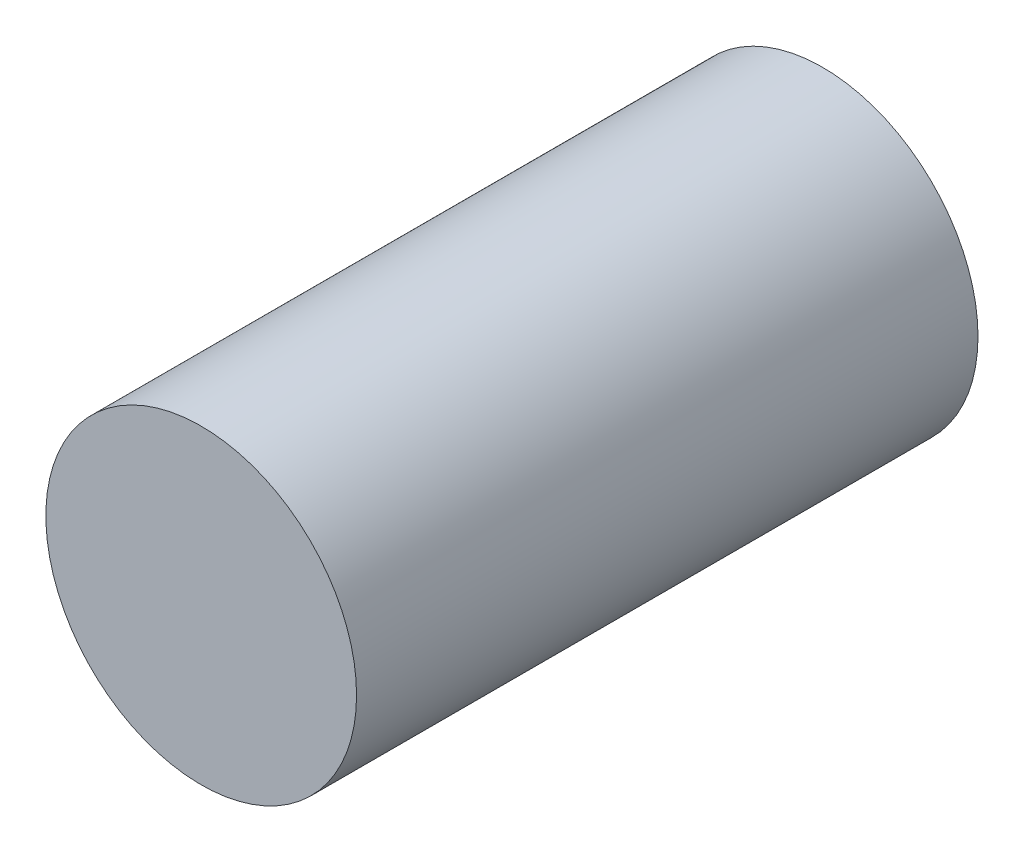
ISO-10303-21;
HEADER;
FILE_DESCRIPTION(('STEP AP214'),'2;1');
FILE_NAME('part.step','',(''),(''),'','','');
FILE_SCHEMA(('AUTOMOTIVE_DESIGN { 1 0 10303 214 1 1 1 1 }'));
ENDSEC;
DATA;
#1=APPLICATION_CONTEXT('core data for automotive mechanical design processes');
#2=APPLICATION_PROTOCOL_DEFINITION('international standard','automotive_design',2000,#1);
#3=PRODUCT_CONTEXT('',#1,'mechanical');
#4=PRODUCT('Part','Part','',(#3));
#5=PRODUCT_RELATED_PRODUCT_CATEGORY('part','',(#4));
#6=PRODUCT_DEFINITION_FORMATION('','',#4);
#7=PRODUCT_DEFINITION_CONTEXT('part definition',#1,'design');
#8=PRODUCT_DEFINITION('design','',#6,#7);
#9=PRODUCT_DEFINITION_SHAPE('','',#8);
#10=(LENGTH_UNIT() NAMED_UNIT(*) SI_UNIT(.MILLI.,.METRE.));
#11=(NAMED_UNIT(*) PLANE_ANGLE_UNIT() SI_UNIT($,.RADIAN.));
#12=(NAMED_UNIT(*) SI_UNIT($,.STERADIAN.) SOLID_ANGLE_UNIT());
#13=UNCERTAINTY_MEASURE_WITH_UNIT(LENGTH_MEASURE(1.E-05),#10,'distance_accuracy_value','');
#14=(GEOMETRIC_REPRESENTATION_CONTEXT(3) GLOBAL_UNCERTAINTY_ASSIGNED_CONTEXT((#13)) GLOBAL_UNIT_ASSIGNED_CONTEXT((#10,
#11,#12)) REPRESENTATION_CONTEXT('',''));
#15=CARTESIAN_POINT('',(0.,0.,0.));
#16=DIRECTION('',(0.,0.,1.));
#17=DIRECTION('',(1.,0.,0.));
#18=AXIS2_PLACEMENT_3D('',#15,#16,#17);
#19=CARTESIAN_POINT('',(0.,0.,2.00000108));
#20=DIRECTION('',(0.,0.,1.));
#21=DIRECTION('',(1.,0.,0.));
#22=AXIS2_PLACEMENT_3D('',#19,#20,#21);
#23=PLANE('',#22);
#24=CARTESIAN_POINT('',(0.,0.,2.00000108));
#25=DIRECTION('',(0.,0.,1.));
#26=DIRECTION('',(1.,0.,0.));
#27=AXIS2_PLACEMENT_3D('',#24,#25,#26);
#28=CIRCLE('',#27,0.499999);
#29=CARTESIAN_POINT('',(0.499999,0.,2.00000108));
#30=VERTEX_POINT('',#29);
#31=EDGE_CURVE('E10',#30,#30,#28,.T.);
#32=ORIENTED_EDGE('',*,*,#31,.T.);
#33=EDGE_LOOP('',(#32));
#34=FACE_BOUND('',#33,.T.);
#35=ADVANCED_FACE('F15',(#34),#23,.T.);
#36=CARTESIAN_POINT('',(0.,0.,0.));
#37=DIRECTION('',(0.,0.,1.));
#38=DIRECTION('',(1.,0.,0.));
#39=AXIS2_PLACEMENT_3D('',#36,#37,#38);
#40=PLANE('',#39);
#41=CARTESIAN_POINT('',(0.,0.,0.));
#42=DIRECTION('',(0.,0.,1.));
#43=DIRECTION('',(1.,0.,0.));
#44=AXIS2_PLACEMENT_3D('',#41,#42,#43);
#45=CIRCLE('',#44,0.499999);
#46=CARTESIAN_POINT('',(0.499999,0.,0.));
#47=VERTEX_POINT('',#46);
#48=EDGE_CURVE('E23',#47,#47,#45,.T.);
#49=ORIENTED_EDGE('',*,*,#48,.F.);
#50=EDGE_LOOP('',(#49));
#51=FACE_BOUND('',#50,.T.);
#52=ADVANCED_FACE('F17',(#51),#40,.F.);
#53=CARTESIAN_POINT('',(0.,0.,0.));
#54=DIRECTION('',(0.,0.,-1.));
#55=DIRECTION('',(1.,0.,0.));
#56=AXIS2_PLACEMENT_3D('',#53,#54,#55);
#57=CYLINDRICAL_SURFACE('',#56,0.499999);
#58=ORIENTED_EDGE('',*,*,#31,.F.);
#59=EDGE_LOOP('',(#58));
#60=FACE_BOUND('',#59,.T.);
#61=ORIENTED_EDGE('',*,*,#48,.T.);
#62=EDGE_LOOP('',(#61));
#63=FACE_BOUND('',#62,.T.);
#64=ADVANCED_FACE('F36',(#60,#63),#57,.T.);
#65=CLOSED_SHELL('',(#35,#52,#64));
#66=MANIFOLD_SOLID_BREP('B1',#65);
#67=ADVANCED_BREP_SHAPE_REPRESENTATION('',(#18,#66),#14);
#68=SHAPE_DEFINITION_REPRESENTATION(#9,#67);
ENDSEC;
END-ISO-10303-21;
